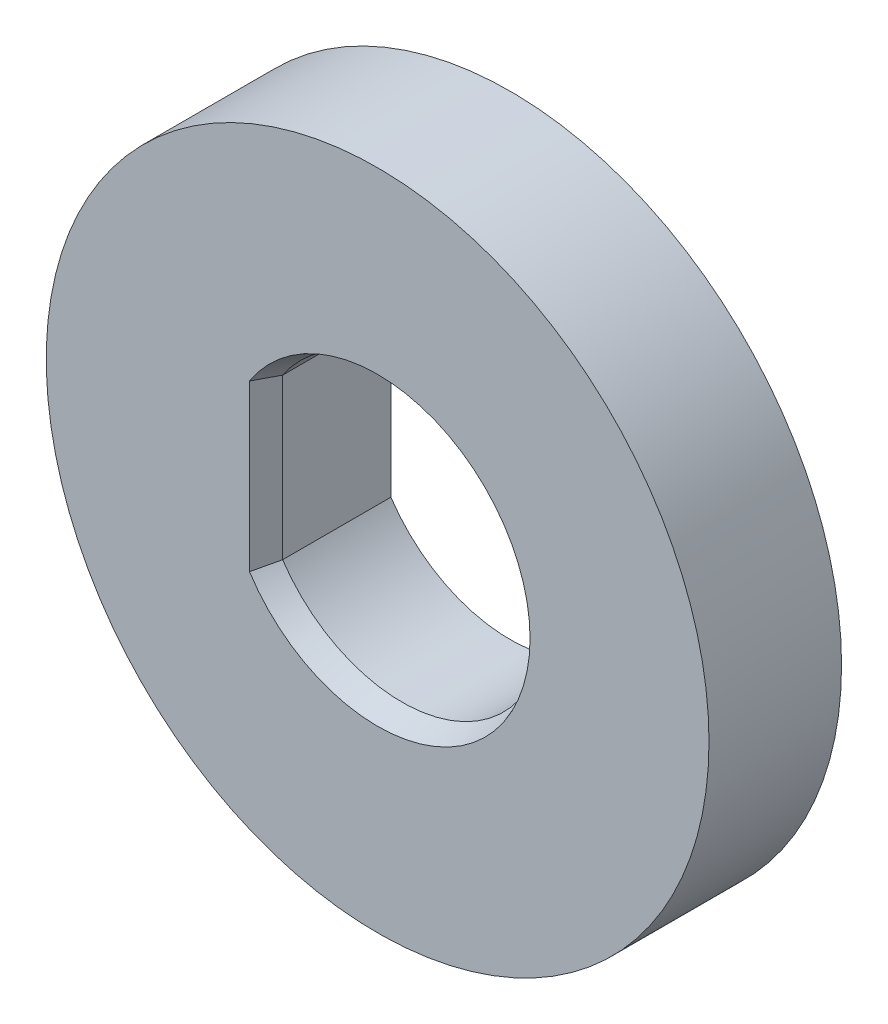
ISO-10303-21;
HEADER;
FILE_DESCRIPTION(('STEP AP214'),'2;1');
FILE_NAME('part.step','',(''),(''),'','','');
FILE_SCHEMA(('AUTOMOTIVE_DESIGN { 1 0 10303 214 1 1 1 1 }'));
ENDSEC;
DATA;
#1=APPLICATION_CONTEXT('core data for automotive mechanical design processes');
#2=APPLICATION_PROTOCOL_DEFINITION('international standard','automotive_design',2000,#1);
#3=PRODUCT_CONTEXT('',#1,'mechanical');
#4=PRODUCT('Part','Part','',(#3));
#5=PRODUCT_RELATED_PRODUCT_CATEGORY('part','',(#4));
#6=PRODUCT_DEFINITION_FORMATION('','',#4);
#7=PRODUCT_DEFINITION_CONTEXT('part definition',#1,'design');
#8=PRODUCT_DEFINITION('design','',#6,#7);
#9=PRODUCT_DEFINITION_SHAPE('','',#8);
#10=(LENGTH_UNIT() NAMED_UNIT(*) SI_UNIT(.MILLI.,.METRE.));
#11=(NAMED_UNIT(*) PLANE_ANGLE_UNIT() SI_UNIT($,.RADIAN.));
#12=(NAMED_UNIT(*) SI_UNIT($,.STERADIAN.) SOLID_ANGLE_UNIT());
#13=UNCERTAINTY_MEASURE_WITH_UNIT(LENGTH_MEASURE(1.E-05),#10,'distance_accuracy_value','');
#14=(GEOMETRIC_REPRESENTATION_CONTEXT(3) GLOBAL_UNCERTAINTY_ASSIGNED_CONTEXT((#13)) GLOBAL_UNIT_ASSIGNED_CONTEXT((#10,
#11,#12)) REPRESENTATION_CONTEXT('',''));
#15=CARTESIAN_POINT('',(0.,0.,0.));
#16=DIRECTION('',(0.,0.,1.));
#17=DIRECTION('',(1.,0.,0.));
#18=AXIS2_PLACEMENT_3D('',#15,#16,#17);
#19=CARTESIAN_POINT('',(0.,0.,3.));
#20=DIRECTION('',(0.,0.,-1.));
#21=DIRECTION('',(-1.,0.,0.));
#22=AXIS2_PLACEMENT_3D('',#19,#20,#21);
#23=CYLINDRICAL_SURFACE('',#22,3.25);
#24=DIRECTION('',(0.,0.,-1.));
#25=VECTOR('',#24,1.);
#26=CARTESIAN_POINT('',(-2.7,-1.80900525151255,3.));
#27=LINE('',#26,#25);
#28=CARTESIAN_POINT('',(-2.7,-1.80900525151255,2.45050451610908));
#29=VERTEX_POINT('',#28);
#30=CARTESIAN_POINT('',(-2.7,-1.80900525151255,0.));
#31=VERTEX_POINT('',#30);
#32=EDGE_CURVE('E80',#29,#31,#27,.T.);
#33=ORIENTED_EDGE('',*,*,#32,.F.);
#34=CARTESIAN_POINT('',(0.,0.,2.45050451610908));
#35=DIRECTION('',(0.,0.,1.));
#36=DIRECTION('',(1.,0.,0.));
#37=AXIS2_PLACEMENT_3D('',#34,#35,#36);
#38=CIRCLE('',#37,3.25);
#39=CARTESIAN_POINT('',(-2.7,1.80900525151255,2.45050451610908));
#40=VERTEX_POINT('',#39);
#41=EDGE_CURVE('E11',#29,#40,#38,.T.);
#42=ORIENTED_EDGE('',*,*,#41,.T.);
#43=DIRECTION('',(0.,0.,-1.));
#44=VECTOR('',#43,1.);
#45=CARTESIAN_POINT('',(-2.7,1.80900525151255,3.));
#46=LINE('',#45,#44);
#47=CARTESIAN_POINT('',(-2.7,1.80900525151255,0.));
#48=VERTEX_POINT('',#47);
#49=EDGE_CURVE('E88',#40,#48,#46,.T.);
#50=ORIENTED_EDGE('',*,*,#49,.T.);
#51=CARTESIAN_POINT('',(0.,0.,0.));
#52=DIRECTION('',(0.,0.,1.));
#53=DIRECTION('',(1.,0.,0.));
#54=AXIS2_PLACEMENT_3D('',#51,#52,#53);
#55=CIRCLE('',#54,3.25);
#56=EDGE_CURVE('E91',#31,#48,#55,.T.);
#57=ORIENTED_EDGE('',*,*,#56,.F.);
#58=EDGE_LOOP('',(#33,#42,#50,#57));
#59=FACE_BOUND('',#58,.T.);
#60=ADVANCED_FACE('F39',(#59),#23,.F.);
#61=CARTESIAN_POINT('',(-2.7,0.,3.));
#62=DIRECTION('',(1.,0.,0.));
#63=DIRECTION('',(0.,0.,-1.));
#64=AXIS2_PLACEMENT_3D('',#61,#62,#63);
#65=PLANE('',#64);
#66=ORIENTED_EDGE('',*,*,#49,.F.);
#67=DIRECTION('',(0.,-1.,0.));
#68=VECTOR('',#67,1.);
#69=CARTESIAN_POINT('',(-2.7,0.,2.45050451610908));
#70=LINE('',#69,#68);
#71=EDGE_CURVE('E86',#40,#29,#70,.T.);
#72=ORIENTED_EDGE('',*,*,#71,.T.);
#73=ORIENTED_EDGE('',*,*,#32,.T.);
#74=DIRECTION('',(0.,-1.,0.));
#75=VECTOR('',#74,1.);
#76=CARTESIAN_POINT('',(-2.7,0.,0.));
#77=LINE('',#76,#75);
#78=EDGE_CURVE('E85',#48,#31,#77,.T.);
#79=ORIENTED_EDGE('',*,*,#78,.F.);
#80=EDGE_LOOP('',(#66,#72,#73,#79));
#81=FACE_BOUND('',#80,.T.);
#82=ADVANCED_FACE('F83',(#81),#65,.T.);
#83=CARTESIAN_POINT('',(0.,0.,3.));
#84=DIRECTION('',(0.,0.,-1.));
#85=DIRECTION('',(-1.,0.,0.));
#86=AXIS2_PLACEMENT_3D('',#83,#84,#85);
#87=CYLINDRICAL_SURFACE('',#86,7.5);
#88=CARTESIAN_POINT('',(0.,0.,3.));
#89=DIRECTION('',(0.,0.,1.));
#90=DIRECTION('',(1.,0.,0.));
#91=AXIS2_PLACEMENT_3D('',#88,#89,#90);
#92=CIRCLE('',#91,7.5);
#93=CARTESIAN_POINT('',(7.5,0.,3.));
#94=VERTEX_POINT('',#93);
#95=EDGE_CURVE('E100',#94,#94,#92,.T.);
#96=ORIENTED_EDGE('',*,*,#95,.F.);
#97=EDGE_LOOP('',(#96));
#98=FACE_BOUND('',#97,.T.);
#99=CARTESIAN_POINT('',(0.,0.,0.));
#100=DIRECTION('',(0.,0.,1.));
#101=DIRECTION('',(1.,0.,0.));
#102=AXIS2_PLACEMENT_3D('',#99,#100,#101);
#103=CIRCLE('',#102,7.5);
#104=CARTESIAN_POINT('',(7.5,0.,0.));
#105=VERTEX_POINT('',#104);
#106=EDGE_CURVE('E96',#105,#105,#103,.T.);
#107=ORIENTED_EDGE('',*,*,#106,.T.);
#108=EDGE_LOOP('',(#107));
#109=FACE_BOUND('',#108,.T.);
#110=ADVANCED_FACE('F120',(#98,#109),#87,.T.);
#111=CARTESIAN_POINT('',(0.,0.,3.));
#112=DIRECTION('',(0.,0.,1.));
#113=DIRECTION('',(1.,0.,0.));
#114=AXIS2_PLACEMENT_3D('',#111,#112,#113);
#115=PLANE('',#114);
#116=CARTESIAN_POINT('',(0.,0.,3.));
#117=DIRECTION('',(0.,0.,1.));
#118=DIRECTION('',(1.,0.,0.));
#119=AXIS2_PLACEMENT_3D('',#116,#117,#118);
#120=CIRCLE('',#119,3.45);
#121=CARTESIAN_POINT('',(-2.89999999999999,1.86882315910308,3.));
#122=VERTEX_POINT('',#121);
#123=CARTESIAN_POINT('',(-2.89999999999999,-1.86882315910308,3.));
#124=VERTEX_POINT('',#123);
#125=EDGE_CURVE('E59',#122,#124,#120,.F.);
#126=ORIENTED_EDGE('',*,*,#125,.T.);
#127=DIRECTION('',(0.,1.,0.));
#128=VECTOR('',#127,1.);
#129=CARTESIAN_POINT('',(-2.9,0.,3.));
#130=LINE('',#129,#128);
#131=EDGE_CURVE('E52',#124,#122,#130,.T.);
#132=ORIENTED_EDGE('',*,*,#131,.T.);
#133=EDGE_LOOP('',(#126,#132));
#134=FACE_BOUND('',#133,.T.);
#135=ORIENTED_EDGE('',*,*,#95,.T.);
#136=EDGE_LOOP('',(#135));
#137=FACE_BOUND('',#136,.T.);
#138=ADVANCED_FACE('F123',(#134,#137),#115,.T.);
#139=CARTESIAN_POINT('',(0.,0.,0.));
#140=DIRECTION('',(0.,0.,1.));
#141=DIRECTION('',(1.,0.,0.));
#142=AXIS2_PLACEMENT_3D('',#139,#140,#141);
#143=PLANE('',#142);
#144=ORIENTED_EDGE('',*,*,#56,.T.);
#145=ORIENTED_EDGE('',*,*,#78,.T.);
#146=EDGE_LOOP('',(#144,#145));
#147=FACE_BOUND('',#146,.T.);
#148=ORIENTED_EDGE('',*,*,#106,.F.);
#149=EDGE_LOOP('',(#148));
#150=FACE_BOUND('',#149,.T.);
#151=ADVANCED_FACE('F94',(#147,#150),#143,.F.);
#152=CARTESIAN_POINT('',(0.,0.,2.45050451610908));
#153=DIRECTION('',(0.,0.,1.));
#154=DIRECTION('',(1.,0.,0.));
#155=AXIS2_PLACEMENT_3D('',#152,#153,#154);
#156=CONICAL_SURFACE('',#155,3.25,0.349065850398865);
#157=CARTESIAN_POINT('',(-2.7,-1.80900525151255,2.45050451610908));
#158=CARTESIAN_POINT('',(-2.73332771997079,-1.81913536441518,2.54207167417073));
#159=CARTESIAN_POINT('',(-2.7666582469601,-1.82918524659826,2.63364654445239));
#160=CARTESIAN_POINT('',(-2.83332491362699,-1.84912454912195,2.81681170574998));
#161=CARTESIAN_POINT('',(-2.86666105330435,-1.85901396946904,2.9084019967653));
#162=CARTESIAN_POINT('',(-2.9,-1.86882315910308,3.));
#163=B_SPLINE_CURVE_WITH_KNOTS('',3,(#157,#158,#159,#160,#161,#162),.UNSPECIFIED.,.F.,.F.,(4,2,
4),(0.,0.293906327348407,0.587812642804443),.UNSPECIFIED.);
#164=EDGE_CURVE('E107',#124,#29,#163,.F.);
#165=ORIENTED_EDGE('',*,*,#164,.F.);
#166=ORIENTED_EDGE('',*,*,#125,.F.);
#167=CARTESIAN_POINT('',(-2.9,1.86882315910308,3.));
#168=CARTESIAN_POINT('',(-2.86666105330435,1.85901396946904,2.9084019967653));
#169=CARTESIAN_POINT('',(-2.83332491362699,1.84912454912194,2.81681170574998));
#170=CARTESIAN_POINT('',(-2.7666582469601,1.82918524659826,2.63364654445239));
#171=CARTESIAN_POINT('',(-2.73332771997079,1.81913536441518,2.54207167417073));
#172=CARTESIAN_POINT('',(-2.7,1.80900525151256,2.45050451610908));
#173=B_SPLINE_CURVE_WITH_KNOTS('',3,(#167,#168,#169,#170,#171,#172),.UNSPECIFIED.,.F.,.F.,(4,2,
4),(0.,0.293906315456037,0.587812642804443),.UNSPECIFIED.);
#174=EDGE_CURVE('E44',#40,#122,#173,.F.);
#175=ORIENTED_EDGE('',*,*,#174,.F.);
#176=ORIENTED_EDGE('',*,*,#41,.F.);
#177=EDGE_LOOP('',(#165,#166,#175,#176));
#178=FACE_BOUND('',#177,.T.);
#179=ADVANCED_FACE('F41',(#178),#156,.F.);
#180=CARTESIAN_POINT('',(-2.7,0.,2.45050451610908));
#181=DIRECTION('',(-0.939692620785909,0.,-0.342020143325668));
#182=DIRECTION('',(0.,-1.,0.));
#183=AXIS2_PLACEMENT_3D('',#180,#181,#182);
#184=PLANE('',#183);
#185=ORIENTED_EDGE('',*,*,#174,.T.);
#186=ORIENTED_EDGE('',*,*,#131,.F.);
#187=ORIENTED_EDGE('',*,*,#164,.T.);
#188=ORIENTED_EDGE('',*,*,#71,.F.);
#189=EDGE_LOOP('',(#185,#186,#187,#188));
#190=FACE_BOUND('',#189,.T.);
#191=ADVANCED_FACE('F111',(#190),#184,.F.);
#192=CLOSED_SHELL('',(#60,#82,#110,#138,#151,#179,#191));
#193=MANIFOLD_SOLID_BREP('B2',#192);
#194=ADVANCED_BREP_SHAPE_REPRESENTATION('',(#18,#193),#14);
#195=SHAPE_DEFINITION_REPRESENTATION(#9,#194);
ENDSEC;
END-ISO-10303-21;
